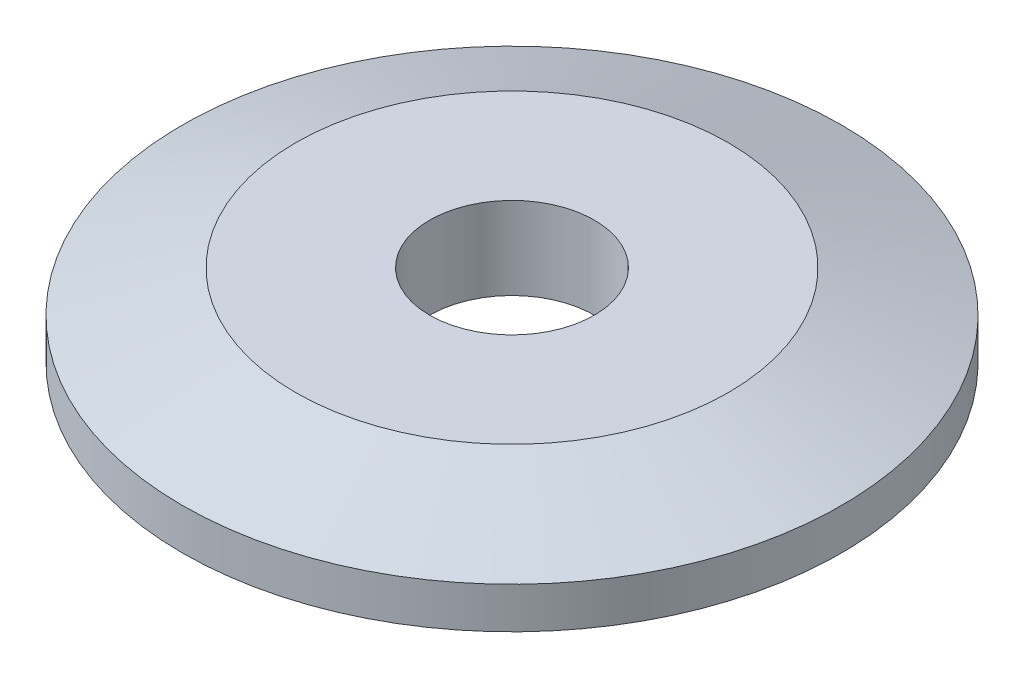
ISO-10303-21;
HEADER;
FILE_DESCRIPTION(('STEP AP214'),'2;1');
FILE_NAME('part.step','',(''),(''),'','','');
FILE_SCHEMA(('AUTOMOTIVE_DESIGN { 1 0 10303 214 1 1 1 1 }'));
ENDSEC;
DATA;
#1=APPLICATION_CONTEXT('core data for automotive mechanical design processes');
#2=APPLICATION_PROTOCOL_DEFINITION('international standard','automotive_design',2000,#1);
#3=PRODUCT_CONTEXT('',#1,'mechanical');
#4=PRODUCT('Part','Part','',(#3));
#5=PRODUCT_RELATED_PRODUCT_CATEGORY('part','',(#4));
#6=PRODUCT_DEFINITION_FORMATION('','',#4);
#7=PRODUCT_DEFINITION_CONTEXT('part definition',#1,'design');
#8=PRODUCT_DEFINITION('design','',#6,#7);
#9=PRODUCT_DEFINITION_SHAPE('','',#8);
#10=(LENGTH_UNIT() NAMED_UNIT(*) SI_UNIT(.MILLI.,.METRE.));
#11=(NAMED_UNIT(*) PLANE_ANGLE_UNIT() SI_UNIT($,.RADIAN.));
#12=(NAMED_UNIT(*) SI_UNIT($,.STERADIAN.) SOLID_ANGLE_UNIT());
#13=UNCERTAINTY_MEASURE_WITH_UNIT(LENGTH_MEASURE(1.E-05),#10,'distance_accuracy_value','');
#14=(GEOMETRIC_REPRESENTATION_CONTEXT(3) GLOBAL_UNCERTAINTY_ASSIGNED_CONTEXT((#13)) GLOBAL_UNIT_ASSIGNED_CONTEXT((#10,
#11,#12)) REPRESENTATION_CONTEXT('',''));
#15=CARTESIAN_POINT('',(0.,0.,0.));
#16=DIRECTION('',(0.,0.,1.));
#17=DIRECTION('',(1.,0.,0.));
#18=AXIS2_PLACEMENT_3D('',#15,#16,#17);
#19=CARTESIAN_POINT('',(0.,2.,0.));
#20=DIRECTION('',(0.,-1.,0.));
#21=DIRECTION('',(0.,0.,-1.));
#22=AXIS2_PLACEMENT_3D('',#19,#20,#21);
#23=CYLINDRICAL_SURFACE('',#22,8.);
#24=CARTESIAN_POINT('',(0.,1.,0.));
#25=DIRECTION('',(0.,1.,0.));
#26=DIRECTION('',(0.,0.,1.));
#27=AXIS2_PLACEMENT_3D('',#24,#25,#26);
#28=CIRCLE('',#27,8.);
#29=CARTESIAN_POINT('',(0.,1.,8.));
#30=VERTEX_POINT('',#29);
#31=EDGE_CURVE('E10',#30,#30,#28,.F.);
#32=ORIENTED_EDGE('',*,*,#31,.T.);
#33=EDGE_LOOP('',(#32));
#34=FACE_BOUND('',#33,.T.);
#35=CARTESIAN_POINT('',(0.,0.,0.));
#36=DIRECTION('',(0.,1.,0.));
#37=DIRECTION('',(0.,0.,1.));
#38=AXIS2_PLACEMENT_3D('',#35,#36,#37);
#39=CIRCLE('',#38,8.);
#40=CARTESIAN_POINT('',(0.,0.,8.));
#41=VERTEX_POINT('',#40);
#42=EDGE_CURVE('E42',#41,#41,#39,.T.);
#43=ORIENTED_EDGE('',*,*,#42,.T.);
#44=EDGE_LOOP('',(#43));
#45=FACE_BOUND('',#44,.T.);
#46=ADVANCED_FACE('F31',(#34,#45),#23,.T.);
#47=CARTESIAN_POINT('',(0.,2.,0.));
#48=DIRECTION('',(0.,1.,0.));
#49=DIRECTION('',(0.,0.,1.));
#50=AXIS2_PLACEMENT_3D('',#47,#48,#49);
#51=PLANE('',#50);
#52=CARTESIAN_POINT('',(0.,2.,0.));
#53=DIRECTION('',(0.,1.,0.));
#54=DIRECTION('',(0.,0.,1.));
#55=AXIS2_PLACEMENT_3D('',#52,#53,#54);
#56=CIRCLE('',#55,2.);
#57=CARTESIAN_POINT('',(0.,2.,2.));
#58=VERTEX_POINT('',#57);
#59=EDGE_CURVE('E49',#58,#58,#56,.T.);
#60=ORIENTED_EDGE('',*,*,#59,.F.);
#61=EDGE_LOOP('',(#60));
#62=FACE_BOUND('',#61,.T.);
#63=CARTESIAN_POINT('',(0.,2.,0.));
#64=DIRECTION('',(0.,1.,0.));
#65=DIRECTION('',(0.,0.,1.));
#66=AXIS2_PLACEMENT_3D('',#63,#64,#65);
#67=CIRCLE('',#66,5.25252258054539);
#68=CARTESIAN_POINT('',(0.,2.,5.25252258054539));
#69=VERTEX_POINT('',#68);
#70=EDGE_CURVE('E38',#69,#69,#67,.T.);
#71=ORIENTED_EDGE('',*,*,#70,.T.);
#72=EDGE_LOOP('',(#71));
#73=FACE_BOUND('',#72,.T.);
#74=ADVANCED_FACE('F64',(#62,#73),#51,.T.);
#75=CARTESIAN_POINT('',(0.,0.,0.));
#76=DIRECTION('',(0.,1.,0.));
#77=DIRECTION('',(0.,0.,1.));
#78=AXIS2_PLACEMENT_3D('',#75,#76,#77);
#79=PLANE('',#78);
#80=CARTESIAN_POINT('',(0.,0.,0.));
#81=DIRECTION('',(0.,1.,0.));
#82=DIRECTION('',(0.,0.,1.));
#83=AXIS2_PLACEMENT_3D('',#80,#81,#82);
#84=CIRCLE('',#83,2.);
#85=CARTESIAN_POINT('',(0.,0.,2.));
#86=VERTEX_POINT('',#85);
#87=EDGE_CURVE('E46',#86,#86,#84,.T.);
#88=ORIENTED_EDGE('',*,*,#87,.T.);
#89=EDGE_LOOP('',(#88));
#90=FACE_BOUND('',#89,.T.);
#91=ORIENTED_EDGE('',*,*,#42,.F.);
#92=EDGE_LOOP('',(#91));
#93=FACE_BOUND('',#92,.T.);
#94=ADVANCED_FACE('F55',(#90,#93),#79,.F.);
#95=CARTESIAN_POINT('',(0.,2.,0.));
#96=DIRECTION('',(0.,-1.,0.));
#97=DIRECTION('',(0.,0.,-1.));
#98=AXIS2_PLACEMENT_3D('',#95,#96,#97);
#99=CONICAL_SURFACE('',#98,5.25252258054539,1.22173047639603);
#100=ORIENTED_EDGE('',*,*,#31,.F.);
#101=EDGE_LOOP('',(#100));
#102=FACE_BOUND('',#101,.T.);
#103=ORIENTED_EDGE('',*,*,#70,.F.);
#104=EDGE_LOOP('',(#103));
#105=FACE_BOUND('',#104,.T.);
#106=ADVANCED_FACE('F33',(#102,#105),#99,.T.);
#107=CARTESIAN_POINT('',(0.,0.,0.));
#108=DIRECTION('',(0.,1.,0.));
#109=DIRECTION('',(0.,0.,1.));
#110=AXIS2_PLACEMENT_3D('',#107,#108,#109);
#111=CYLINDRICAL_SURFACE('',#110,2.);
#112=ORIENTED_EDGE('',*,*,#87,.F.);
#113=EDGE_LOOP('',(#112));
#114=FACE_BOUND('',#113,.T.);
#115=ORIENTED_EDGE('',*,*,#59,.T.);
#116=EDGE_LOOP('',(#115));
#117=FACE_BOUND('',#116,.T.);
#118=ADVANCED_FACE('F58',(#114,#117),#111,.F.);
#119=CLOSED_SHELL('',(#46,#74,#94,#106,#118));
#120=MANIFOLD_SOLID_BREP('B2',#119);
#121=ADVANCED_BREP_SHAPE_REPRESENTATION('',(#18,#120),#14);
#122=SHAPE_DEFINITION_REPRESENTATION(#9,#121);
ENDSEC;
END-ISO-10303-21;
